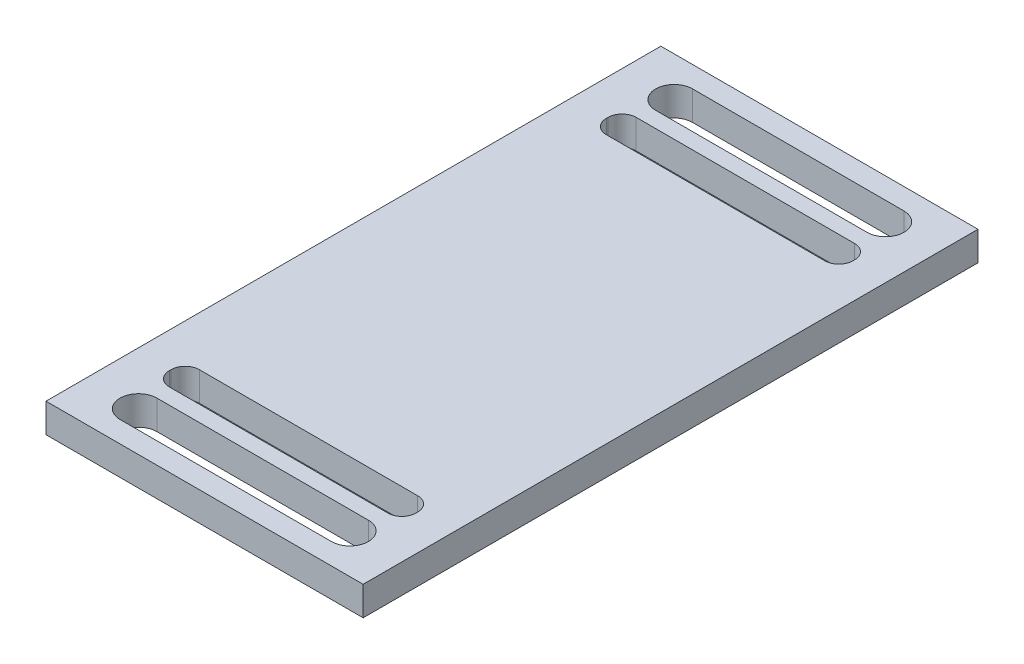
ISO-10303-21;
HEADER;
FILE_DESCRIPTION(('STEP AP214'),'2;1');
FILE_NAME('part.step','',(''),(''),'','','');
FILE_SCHEMA(('AUTOMOTIVE_DESIGN { 1 0 10303 214 1 1 1 1 }'));
ENDSEC;
DATA;
#1=APPLICATION_CONTEXT('core data for automotive mechanical design processes');
#2=APPLICATION_PROTOCOL_DEFINITION('international standard','automotive_design',2000,#1);
#3=PRODUCT_CONTEXT('',#1,'mechanical');
#4=PRODUCT('Part','Part','',(#3));
#5=PRODUCT_RELATED_PRODUCT_CATEGORY('part','',(#4));
#6=PRODUCT_DEFINITION_FORMATION('','',#4);
#7=PRODUCT_DEFINITION_CONTEXT('part definition',#1,'design');
#8=PRODUCT_DEFINITION('design','',#6,#7);
#9=PRODUCT_DEFINITION_SHAPE('','',#8);
#10=(LENGTH_UNIT() NAMED_UNIT(*) SI_UNIT(.MILLI.,.METRE.));
#11=(NAMED_UNIT(*) PLANE_ANGLE_UNIT() SI_UNIT($,.RADIAN.));
#12=(NAMED_UNIT(*) SI_UNIT($,.STERADIAN.) SOLID_ANGLE_UNIT());
#13=UNCERTAINTY_MEASURE_WITH_UNIT(LENGTH_MEASURE(1.E-05),#10,'distance_accuracy_value','');
#14=(GEOMETRIC_REPRESENTATION_CONTEXT(3) GLOBAL_UNCERTAINTY_ASSIGNED_CONTEXT((#13)) GLOBAL_UNIT_ASSIGNED_CONTEXT((#10,
#11,#12)) REPRESENTATION_CONTEXT('',''));
#15=CARTESIAN_POINT('',(0.,0.,0.));
#16=DIRECTION('',(0.,0.,1.));
#17=DIRECTION('',(1.,0.,0.));
#18=AXIS2_PLACEMENT_3D('',#15,#16,#17);
#19=CARTESIAN_POINT('',(-9.,-0.825,-17.45));
#20=DIRECTION('',(-1.,0.,0.));
#21=DIRECTION('',(0.,0.,1.));
#22=AXIS2_PLACEMENT_3D('',#19,#20,#21);
#23=PLANE('',#22);
#24=DIRECTION('',(0.,0.,1.));
#25=VECTOR('',#24,1.);
#26=CARTESIAN_POINT('',(-9.,0.825,-17.45));
#27=LINE('',#26,#25);
#28=CARTESIAN_POINT('',(-9.,0.825,-17.45));
#29=VERTEX_POINT('',#28);
#30=CARTESIAN_POINT('',(-9.,0.825,17.45));
#31=VERTEX_POINT('',#30);
#32=EDGE_CURVE('E309',#29,#31,#27,.T.);
#33=ORIENTED_EDGE('',*,*,#32,.F.);
#34=DIRECTION('',(0.,1.,0.));
#35=VECTOR('',#34,1.);
#36=CARTESIAN_POINT('',(-9.,-0.825,-17.45));
#37=LINE('',#36,#35);
#38=CARTESIAN_POINT('',(-9.,-0.825,-17.45));
#39=VERTEX_POINT('',#38);
#40=EDGE_CURVE('E343',#39,#29,#37,.T.);
#41=ORIENTED_EDGE('',*,*,#40,.F.);
#42=DIRECTION('',(0.,0.,1.));
#43=VECTOR('',#42,1.);
#44=CARTESIAN_POINT('',(-9.,-0.825,-17.45));
#45=LINE('',#44,#43);
#46=CARTESIAN_POINT('',(-9.,-0.825,17.45));
#47=VERTEX_POINT('',#46);
#48=EDGE_CURVE('E319',#39,#47,#45,.T.);
#49=ORIENTED_EDGE('',*,*,#48,.T.);
#50=DIRECTION('',(0.,1.,0.));
#51=VECTOR('',#50,1.);
#52=CARTESIAN_POINT('',(-9.,-0.825,17.45));
#53=LINE('',#52,#51);
#54=EDGE_CURVE('E332',#47,#31,#53,.T.);
#55=ORIENTED_EDGE('',*,*,#54,.T.);
#56=EDGE_LOOP('',(#33,#41,#49,#55));
#57=FACE_BOUND('',#56,.T.);
#58=ADVANCED_FACE('F33',(#57),#23,.T.);
#59=CARTESIAN_POINT('',(-9.,-0.825,-17.45));
#60=DIRECTION('',(0.,0.,-1.));
#61=DIRECTION('',(-1.,0.,0.));
#62=AXIS2_PLACEMENT_3D('',#59,#60,#61);
#63=PLANE('',#62);
#64=DIRECTION('',(-1.,0.,0.));
#65=VECTOR('',#64,1.);
#66=CARTESIAN_POINT('',(-9.,0.825,-17.45));
#67=LINE('',#66,#65);
#68=CARTESIAN_POINT('',(9.,0.825,-17.45));
#69=VERTEX_POINT('',#68);
#70=EDGE_CURVE('E323',#69,#29,#67,.T.);
#71=ORIENTED_EDGE('',*,*,#70,.F.);
#72=DIRECTION('',(0.,1.,0.));
#73=VECTOR('',#72,1.);
#74=CARTESIAN_POINT('',(9.,-0.825,-17.45));
#75=LINE('',#74,#73);
#76=CARTESIAN_POINT('',(9.,-0.825,-17.45));
#77=VERTEX_POINT('',#76);
#78=EDGE_CURVE('E346',#77,#69,#75,.T.);
#79=ORIENTED_EDGE('',*,*,#78,.F.);
#80=DIRECTION('',(-1.,0.,0.));
#81=VECTOR('',#80,1.);
#82=CARTESIAN_POINT('',(-9.,-0.825,-17.45));
#83=LINE('',#82,#81);
#84=EDGE_CURVE('E329',#77,#39,#83,.T.);
#85=ORIENTED_EDGE('',*,*,#84,.T.);
#86=ORIENTED_EDGE('',*,*,#40,.T.);
#87=EDGE_LOOP('',(#71,#79,#85,#86));
#88=FACE_BOUND('',#87,.T.);
#89=ADVANCED_FACE('F463',(#88),#63,.T.);
#90=CARTESIAN_POINT('',(9.,-0.825,-17.45));
#91=DIRECTION('',(1.,0.,0.));
#92=DIRECTION('',(0.,0.,-1.));
#93=AXIS2_PLACEMENT_3D('',#90,#91,#92);
#94=PLANE('',#93);
#95=DIRECTION('',(0.,0.,-1.));
#96=VECTOR('',#95,1.);
#97=CARTESIAN_POINT('',(9.,0.825,-17.45));
#98=LINE('',#97,#96);
#99=CARTESIAN_POINT('',(9.,0.825,17.45));
#100=VERTEX_POINT('',#99);
#101=EDGE_CURVE('E338',#100,#69,#98,.T.);
#102=ORIENTED_EDGE('',*,*,#101,.F.);
#103=DIRECTION('',(0.,1.,0.));
#104=VECTOR('',#103,1.);
#105=CARTESIAN_POINT('',(9.,-0.825,17.45));
#106=LINE('',#105,#104);
#107=CARTESIAN_POINT('',(9.,-0.825,17.45));
#108=VERTEX_POINT('',#107);
#109=EDGE_CURVE('E348',#108,#100,#106,.T.);
#110=ORIENTED_EDGE('',*,*,#109,.F.);
#111=DIRECTION('',(0.,0.,-1.));
#112=VECTOR('',#111,1.);
#113=CARTESIAN_POINT('',(9.,-0.825,-17.45));
#114=LINE('',#113,#112);
#115=EDGE_CURVE('E326',#108,#77,#114,.T.);
#116=ORIENTED_EDGE('',*,*,#115,.T.);
#117=ORIENTED_EDGE('',*,*,#78,.T.);
#118=EDGE_LOOP('',(#102,#110,#116,#117));
#119=FACE_BOUND('',#118,.T.);
#120=ADVANCED_FACE('F469',(#119),#94,.T.);
#121=CARTESIAN_POINT('',(-9.,-0.825,17.45));
#122=DIRECTION('',(0.,0.,1.));
#123=DIRECTION('',(1.,0.,0.));
#124=AXIS2_PLACEMENT_3D('',#121,#122,#123);
#125=PLANE('',#124);
#126=DIRECTION('',(1.,0.,0.));
#127=VECTOR('',#126,1.);
#128=CARTESIAN_POINT('',(-9.,0.825,17.45));
#129=LINE('',#128,#127);
#130=EDGE_CURVE('E335',#31,#100,#129,.T.);
#131=ORIENTED_EDGE('',*,*,#130,.F.);
#132=ORIENTED_EDGE('',*,*,#54,.F.);
#133=DIRECTION('',(1.,0.,0.));
#134=VECTOR('',#133,1.);
#135=CARTESIAN_POINT('',(-9.,-0.825,17.45));
#136=LINE('',#135,#134);
#137=EDGE_CURVE('E322',#47,#108,#136,.T.);
#138=ORIENTED_EDGE('',*,*,#137,.T.);
#139=ORIENTED_EDGE('',*,*,#109,.T.);
#140=EDGE_LOOP('',(#131,#132,#138,#139));
#141=FACE_BOUND('',#140,.T.);
#142=ADVANCED_FACE('F475',(#141),#125,.T.);
#143=CARTESIAN_POINT('',(0.,-0.825,0.));
#144=DIRECTION('',(0.,1.,0.));
#145=DIRECTION('',(0.,0.,1.));
#146=AXIS2_PLACEMENT_3D('',#143,#144,#145);
#147=PLANE('',#146);
#148=DIRECTION('',(-1.,0.,0.));
#149=VECTOR('',#148,1.);
#150=CARTESIAN_POINT('',(-7.,-0.825,11.55));
#151=LINE('',#150,#149);
#152=CARTESIAN_POINT('',(6.2,-0.825,11.55));
#153=VERTEX_POINT('',#152);
#154=CARTESIAN_POINT('',(-6.2,-0.825,11.55));
#155=VERTEX_POINT('',#154);
#156=EDGE_CURVE('E509',#153,#155,#151,.T.);
#157=ORIENTED_EDGE('',*,*,#156,.T.);
#158=CARTESIAN_POINT('',(-6.2,-0.825,12.35));
#159=DIRECTION('',(0.,1.,0.));
#160=DIRECTION('',(0.,0.,1.));
#161=AXIS2_PLACEMENT_3D('',#158,#159,#160);
#162=CIRCLE('',#161,0.8);
#163=CARTESIAN_POINT('',(-7.,-0.825,12.35));
#164=VERTEX_POINT('',#163);
#165=EDGE_CURVE('E403',#155,#164,#162,.T.);
#166=ORIENTED_EDGE('',*,*,#165,.T.);
#167=DIRECTION('',(0.,0.,1.));
#168=VECTOR('',#167,1.);
#169=CARTESIAN_POINT('',(-7.,-0.825,13.25));
#170=LINE('',#169,#168);
#171=CARTESIAN_POINT('',(-7.,-0.825,12.45));
#172=VERTEX_POINT('',#171);
#173=EDGE_CURVE('E256',#164,#172,#170,.T.);
#174=ORIENTED_EDGE('',*,*,#173,.T.);
#175=CARTESIAN_POINT('',(-6.2,-0.825,12.45));
#176=DIRECTION('',(0.,1.,0.));
#177=DIRECTION('',(0.,0.,1.));
#178=AXIS2_PLACEMENT_3D('',#175,#176,#177);
#179=CIRCLE('',#178,0.8);
#180=CARTESIAN_POINT('',(-6.2,-0.825,13.25));
#181=VERTEX_POINT('',#180);
#182=EDGE_CURVE('E399',#172,#181,#179,.T.);
#183=ORIENTED_EDGE('',*,*,#182,.T.);
#184=DIRECTION('',(1.,0.,0.));
#185=VECTOR('',#184,1.);
#186=CARTESIAN_POINT('',(-7.,-0.825,13.25));
#187=LINE('',#186,#185);
#188=CARTESIAN_POINT('',(6.2,-0.825,13.25));
#189=VERTEX_POINT('',#188);
#190=EDGE_CURVE('E498',#181,#189,#187,.T.);
#191=ORIENTED_EDGE('',*,*,#190,.T.);
#192=CARTESIAN_POINT('',(6.2,-0.825,12.45));
#193=DIRECTION('',(0.,1.,0.));
#194=DIRECTION('',(0.,0.,1.));
#195=AXIS2_PLACEMENT_3D('',#192,#193,#194);
#196=CIRCLE('',#195,0.8);
#197=CARTESIAN_POINT('',(7.,-0.825,12.45));
#198=VERTEX_POINT('',#197);
#199=EDGE_CURVE('E391',#189,#198,#196,.T.);
#200=ORIENTED_EDGE('',*,*,#199,.T.);
#201=DIRECTION('',(0.,0.,-1.));
#202=VECTOR('',#201,1.);
#203=CARTESIAN_POINT('',(7.,-0.825,13.25));
#204=LINE('',#203,#202);
#205=CARTESIAN_POINT('',(7.,-0.825,12.35));
#206=VERTEX_POINT('',#205);
#207=EDGE_CURVE('E506',#198,#206,#204,.T.);
#208=ORIENTED_EDGE('',*,*,#207,.T.);
#209=CARTESIAN_POINT('',(6.2,-0.825,12.35));
#210=DIRECTION('',(0.,1.,0.));
#211=DIRECTION('',(0.,0.,1.));
#212=AXIS2_PLACEMENT_3D('',#209,#210,#211);
#213=CIRCLE('',#212,0.8);
#214=EDGE_CURVE('E395',#206,#153,#213,.T.);
#215=ORIENTED_EDGE('',*,*,#214,.T.);
#216=EDGE_LOOP('',(#157,#166,#174,#183,#191,#200,#208,#215));
#217=FACE_BOUND('',#216,.T.);
#218=DIRECTION('',(-1.,0.,0.));
#219=VECTOR('',#218,1.);
#220=CARTESIAN_POINT('',(-5.99999999999999,-0.825,14.15));
#221=LINE('',#220,#219);
#222=CARTESIAN_POINT('',(6.,-0.825,14.15));
#223=VERTEX_POINT('',#222);
#224=CARTESIAN_POINT('',(-5.99999999999999,-0.825,14.15));
#225=VERTEX_POINT('',#224);
#226=EDGE_CURVE('E230',#223,#225,#221,.T.);
#227=ORIENTED_EDGE('',*,*,#226,.T.);
#228=CARTESIAN_POINT('',(-5.99999999999999,-0.825,15.2));
#229=DIRECTION('',(0.,1.,0.));
#230=DIRECTION('',(0.,0.,-1.));
#231=AXIS2_PLACEMENT_3D('',#228,#229,#230);
#232=CIRCLE('',#231,1.05);
#233=CARTESIAN_POINT('',(-5.99999999999999,-0.825,16.25));
#234=VERTEX_POINT('',#233);
#235=EDGE_CURVE('E222',#225,#234,#232,.T.);
#236=ORIENTED_EDGE('',*,*,#235,.T.);
#237=DIRECTION('',(1.,0.,0.));
#238=VECTOR('',#237,1.);
#239=CARTESIAN_POINT('',(-5.99999999999999,-0.825,16.25));
#240=LINE('',#239,#238);
#241=CARTESIAN_POINT('',(6.,-0.825,16.25));
#242=VERTEX_POINT('',#241);
#243=EDGE_CURVE('E234',#234,#242,#240,.T.);
#244=ORIENTED_EDGE('',*,*,#243,.T.);
#245=CARTESIAN_POINT('',(6.,-0.825,15.2));
#246=DIRECTION('',(0.,1.,0.));
#247=DIRECTION('',(0.,0.,-1.));
#248=AXIS2_PLACEMENT_3D('',#245,#246,#247);
#249=CIRCLE('',#248,1.05);
#250=EDGE_CURVE('E238',#242,#223,#249,.T.);
#251=ORIENTED_EDGE('',*,*,#250,.T.);
#252=EDGE_LOOP('',(#227,#236,#244,#251));
#253=FACE_BOUND('',#252,.T.);
#254=DIRECTION('',(-1.,0.,0.));
#255=VECTOR('',#254,1.);
#256=CARTESIAN_POINT('',(-6.,-0.825,-16.25));
#257=LINE('',#256,#255);
#258=CARTESIAN_POINT('',(6.,-0.825,-16.25));
#259=VERTEX_POINT('',#258);
#260=CARTESIAN_POINT('',(-6.,-0.825,-16.25));
#261=VERTEX_POINT('',#260);
#262=EDGE_CURVE('E276',#259,#261,#257,.T.);
#263=ORIENTED_EDGE('',*,*,#262,.T.);
#264=CARTESIAN_POINT('',(-6.,-0.825,-15.2));
#265=DIRECTION('',(0.,1.,0.));
#266=DIRECTION('',(0.,0.,1.));
#267=AXIS2_PLACEMENT_3D('',#264,#265,#266);
#268=CIRCLE('',#267,1.05);
#269=CARTESIAN_POINT('',(-5.99999999999999,-0.825,-14.15));
#270=VERTEX_POINT('',#269);
#271=EDGE_CURVE('E266',#261,#270,#268,.T.);
#272=ORIENTED_EDGE('',*,*,#271,.T.);
#273=DIRECTION('',(1.,0.,0.));
#274=VECTOR('',#273,1.);
#275=CARTESIAN_POINT('',(-5.99999999999999,-0.825,-14.15));
#276=LINE('',#275,#274);
#277=CARTESIAN_POINT('',(5.99999999999999,-0.825,-14.15));
#278=VERTEX_POINT('',#277);
#279=EDGE_CURVE('E269',#270,#278,#276,.T.);
#280=ORIENTED_EDGE('',*,*,#279,.T.);
#281=CARTESIAN_POINT('',(6.,-0.825,-15.2));
#282=DIRECTION('',(0.,1.,0.));
#283=DIRECTION('',(0.,0.,1.));
#284=AXIS2_PLACEMENT_3D('',#281,#282,#283);
#285=CIRCLE('',#284,1.05);
#286=EDGE_CURVE('E273',#278,#259,#285,.T.);
#287=ORIENTED_EDGE('',*,*,#286,.T.);
#288=EDGE_LOOP('',(#263,#272,#280,#287));
#289=FACE_BOUND('',#288,.T.);
#290=DIRECTION('',(0.,0.,-1.));
#291=VECTOR('',#290,1.);
#292=CARTESIAN_POINT('',(7.,-0.825,-13.25));
#293=LINE('',#292,#291);
#294=CARTESIAN_POINT('',(7.,-0.825,-12.35));
#295=VERTEX_POINT('',#294);
#296=CARTESIAN_POINT('',(7.,-0.825,-12.45));
#297=VERTEX_POINT('',#296);
#298=EDGE_CURVE('E304',#295,#297,#293,.T.);
#299=ORIENTED_EDGE('',*,*,#298,.T.);
#300=CARTESIAN_POINT('',(6.2,-0.825,-12.45));
#301=DIRECTION('',(0.,1.,0.));
#302=DIRECTION('',(0.,0.,1.));
#303=AXIS2_PLACEMENT_3D('',#300,#301,#302);
#304=CIRCLE('',#303,0.8);
#305=CARTESIAN_POINT('',(6.2,-0.825,-13.25));
#306=VERTEX_POINT('',#305);
#307=EDGE_CURVE('E407',#297,#306,#304,.T.);
#308=ORIENTED_EDGE('',*,*,#307,.T.);
#309=DIRECTION('',(-1.,0.,0.));
#310=VECTOR('',#309,1.);
#311=CARTESIAN_POINT('',(-7.,-0.825,-13.25));
#312=LINE('',#311,#310);
#313=CARTESIAN_POINT('',(-6.2,-0.825,-13.25));
#314=VERTEX_POINT('',#313);
#315=EDGE_CURVE('E307',#306,#314,#312,.T.);
#316=ORIENTED_EDGE('',*,*,#315,.T.);
#317=CARTESIAN_POINT('',(-6.2,-0.825,-12.45));
#318=DIRECTION('',(0.,1.,0.));
#319=DIRECTION('',(0.,0.,1.));
#320=AXIS2_PLACEMENT_3D('',#317,#318,#319);
#321=CIRCLE('',#320,0.8);
#322=CARTESIAN_POINT('',(-7.,-0.825,-12.45));
#323=VERTEX_POINT('',#322);
#324=EDGE_CURVE('E11',#314,#323,#321,.T.);
#325=ORIENTED_EDGE('',*,*,#324,.T.);
#326=DIRECTION('',(0.,0.,1.));
#327=VECTOR('',#326,1.);
#328=CARTESIAN_POINT('',(-7.,-0.825,-13.25));
#329=LINE('',#328,#327);
#330=CARTESIAN_POINT('',(-7.,-0.825,-12.35));
#331=VERTEX_POINT('',#330);
#332=EDGE_CURVE('E298',#323,#331,#329,.T.);
#333=ORIENTED_EDGE('',*,*,#332,.T.);
#334=CARTESIAN_POINT('',(-6.2,-0.825,-12.35));
#335=DIRECTION('',(0.,1.,0.));
#336=DIRECTION('',(0.,0.,1.));
#337=AXIS2_PLACEMENT_3D('',#334,#335,#336);
#338=CIRCLE('',#337,0.8);
#339=CARTESIAN_POINT('',(-6.2,-0.825,-11.55));
#340=VERTEX_POINT('',#339);
#341=EDGE_CURVE('E415',#331,#340,#338,.T.);
#342=ORIENTED_EDGE('',*,*,#341,.T.);
#343=DIRECTION('',(1.,0.,0.));
#344=VECTOR('',#343,1.);
#345=CARTESIAN_POINT('',(-7.,-0.825,-11.55));
#346=LINE('',#345,#344);
#347=CARTESIAN_POINT('',(6.2,-0.825,-11.55));
#348=VERTEX_POINT('',#347);
#349=EDGE_CURVE('E300',#340,#348,#346,.T.);
#350=ORIENTED_EDGE('',*,*,#349,.T.);
#351=CARTESIAN_POINT('',(6.2,-0.825,-12.35));
#352=DIRECTION('',(0.,1.,0.));
#353=DIRECTION('',(0.,0.,1.));
#354=AXIS2_PLACEMENT_3D('',#351,#352,#353);
#355=CIRCLE('',#354,0.8);
#356=EDGE_CURVE('E411',#348,#295,#355,.T.);
#357=ORIENTED_EDGE('',*,*,#356,.T.);
#358=EDGE_LOOP('',(#299,#308,#316,#325,#333,#342,#350,#357));
#359=FACE_BOUND('',#358,.T.);
#360=ORIENTED_EDGE('',*,*,#48,.F.);
#361=ORIENTED_EDGE('',*,*,#84,.F.);
#362=ORIENTED_EDGE('',*,*,#115,.F.);
#363=ORIENTED_EDGE('',*,*,#137,.F.);
#364=EDGE_LOOP('',(#360,#361,#362,#363));
#365=FACE_BOUND('',#364,.T.);
#366=ADVANCED_FACE('F240',(#217,#253,#289,#359,#365),#147,.F.);
#367=CARTESIAN_POINT('',(0.,0.825,0.));
#368=DIRECTION('',(0.,1.,0.));
#369=DIRECTION('',(0.,0.,1.));
#370=AXIS2_PLACEMENT_3D('',#367,#368,#369);
#371=PLANE('',#370);
#372=DIRECTION('',(1.,0.,0.));
#373=VECTOR('',#372,1.);
#374=CARTESIAN_POINT('',(-7.,0.825,13.25));
#375=LINE('',#374,#373);
#376=CARTESIAN_POINT('',(-6.2,0.825,13.25));
#377=VERTEX_POINT('',#376);
#378=CARTESIAN_POINT('',(6.2,0.825,13.25));
#379=VERTEX_POINT('',#378);
#380=EDGE_CURVE('E516',#377,#379,#375,.T.);
#381=ORIENTED_EDGE('',*,*,#380,.F.);
#382=CARTESIAN_POINT('',(-6.2,0.825,12.45));
#383=DIRECTION('',(0.,1.,0.));
#384=DIRECTION('',(0.,0.,1.));
#385=AXIS2_PLACEMENT_3D('',#382,#383,#384);
#386=CIRCLE('',#385,0.8);
#387=CARTESIAN_POINT('',(-7.,0.825,12.45));
#388=VERTEX_POINT('',#387);
#389=EDGE_CURVE('E397',#377,#388,#386,.F.);
#390=ORIENTED_EDGE('',*,*,#389,.T.);
#391=DIRECTION('',(0.,0.,1.));
#392=VECTOR('',#391,1.);
#393=CARTESIAN_POINT('',(-7.,0.825,13.25));
#394=LINE('',#393,#392);
#395=CARTESIAN_POINT('',(-7.,0.825,12.35));
#396=VERTEX_POINT('',#395);
#397=EDGE_CURVE('E249',#396,#388,#394,.T.);
#398=ORIENTED_EDGE('',*,*,#397,.F.);
#399=CARTESIAN_POINT('',(-6.2,0.825,12.35));
#400=DIRECTION('',(0.,1.,0.));
#401=DIRECTION('',(0.,0.,1.));
#402=AXIS2_PLACEMENT_3D('',#399,#400,#401);
#403=CIRCLE('',#402,0.8);
#404=CARTESIAN_POINT('',(-6.2,0.825,11.55));
#405=VERTEX_POINT('',#404);
#406=EDGE_CURVE('E401',#396,#405,#403,.F.);
#407=ORIENTED_EDGE('',*,*,#406,.T.);
#408=DIRECTION('',(-1.,0.,0.));
#409=VECTOR('',#408,1.);
#410=CARTESIAN_POINT('',(-7.,0.825,11.55));
#411=LINE('',#410,#409);
#412=CARTESIAN_POINT('',(6.2,0.825,11.55));
#413=VERTEX_POINT('',#412);
#414=EDGE_CURVE('E512',#413,#405,#411,.T.);
#415=ORIENTED_EDGE('',*,*,#414,.F.);
#416=CARTESIAN_POINT('',(6.2,0.825,12.35));
#417=DIRECTION('',(0.,1.,0.));
#418=DIRECTION('',(0.,0.,1.));
#419=AXIS2_PLACEMENT_3D('',#416,#417,#418);
#420=CIRCLE('',#419,0.8);
#421=CARTESIAN_POINT('',(7.,0.825,12.35));
#422=VERTEX_POINT('',#421);
#423=EDGE_CURVE('E393',#413,#422,#420,.F.);
#424=ORIENTED_EDGE('',*,*,#423,.T.);
#425=DIRECTION('',(0.,0.,-1.));
#426=VECTOR('',#425,1.);
#427=CARTESIAN_POINT('',(7.,0.825,13.25));
#428=LINE('',#427,#426);
#429=CARTESIAN_POINT('',(7.,0.825,12.45));
#430=VERTEX_POINT('',#429);
#431=EDGE_CURVE('E518',#430,#422,#428,.T.);
#432=ORIENTED_EDGE('',*,*,#431,.F.);
#433=CARTESIAN_POINT('',(6.2,0.825,12.45));
#434=DIRECTION('',(0.,1.,0.));
#435=DIRECTION('',(0.,0.,1.));
#436=AXIS2_PLACEMENT_3D('',#433,#434,#435);
#437=CIRCLE('',#436,0.8);
#438=EDGE_CURVE('E389',#430,#379,#437,.F.);
#439=ORIENTED_EDGE('',*,*,#438,.T.);
#440=EDGE_LOOP('',(#381,#390,#398,#407,#415,#424,#432,#439));
#441=FACE_BOUND('',#440,.T.);
#442=CARTESIAN_POINT('',(-5.99999999999999,0.825,15.2));
#443=DIRECTION('',(0.,1.,0.));
#444=DIRECTION('',(0.,0.,-1.));
#445=AXIS2_PLACEMENT_3D('',#442,#443,#444);
#446=CIRCLE('',#445,1.05);
#447=CARTESIAN_POINT('',(-5.99999999999999,0.825,14.15));
#448=VERTEX_POINT('',#447);
#449=CARTESIAN_POINT('',(-5.99999999999999,0.825,16.25));
#450=VERTEX_POINT('',#449);
#451=EDGE_CURVE('E225',#448,#450,#446,.T.);
#452=ORIENTED_EDGE('',*,*,#451,.F.);
#453=DIRECTION('',(-1.,0.,0.));
#454=VECTOR('',#453,1.);
#455=CARTESIAN_POINT('',(-5.99999999999999,0.825,14.15));
#456=LINE('',#455,#454);
#457=CARTESIAN_POINT('',(6.,0.825,14.15));
#458=VERTEX_POINT('',#457);
#459=EDGE_CURVE('E243',#458,#448,#456,.T.);
#460=ORIENTED_EDGE('',*,*,#459,.F.);
#461=CARTESIAN_POINT('',(6.,0.825,15.2));
#462=DIRECTION('',(0.,1.,0.));
#463=DIRECTION('',(0.,0.,-1.));
#464=AXIS2_PLACEMENT_3D('',#461,#462,#463);
#465=CIRCLE('',#464,1.05);
#466=CARTESIAN_POINT('',(6.,0.825,16.25));
#467=VERTEX_POINT('',#466);
#468=EDGE_CURVE('E246',#467,#458,#465,.T.);
#469=ORIENTED_EDGE('',*,*,#468,.F.);
#470=DIRECTION('',(1.,0.,0.));
#471=VECTOR('',#470,1.);
#472=CARTESIAN_POINT('',(-5.99999999999999,0.825,16.25));
#473=LINE('',#472,#471);
#474=EDGE_CURVE('E255',#450,#467,#473,.T.);
#475=ORIENTED_EDGE('',*,*,#474,.F.);
#476=EDGE_LOOP('',(#452,#460,#469,#475));
#477=FACE_BOUND('',#476,.T.);
#478=CARTESIAN_POINT('',(-6.,0.825,-15.2));
#479=DIRECTION('',(0.,1.,0.));
#480=DIRECTION('',(0.,0.,1.));
#481=AXIS2_PLACEMENT_3D('',#478,#479,#480);
#482=CIRCLE('',#481,1.05);
#483=CARTESIAN_POINT('',(-6.,0.825,-16.25));
#484=VERTEX_POINT('',#483);
#485=CARTESIAN_POINT('',(-5.99999999999999,0.825,-14.15));
#486=VERTEX_POINT('',#485);
#487=EDGE_CURVE('E262',#484,#486,#482,.T.);
#488=ORIENTED_EDGE('',*,*,#487,.F.);
#489=DIRECTION('',(-1.,0.,0.));
#490=VECTOR('',#489,1.);
#491=CARTESIAN_POINT('',(-6.,0.825,-16.25));
#492=LINE('',#491,#490);
#493=CARTESIAN_POINT('',(6.,0.825,-16.25));
#494=VERTEX_POINT('',#493);
#495=EDGE_CURVE('E270',#494,#484,#492,.T.);
#496=ORIENTED_EDGE('',*,*,#495,.F.);
#497=CARTESIAN_POINT('',(6.,0.825,-15.2));
#498=DIRECTION('',(0.,1.,0.));
#499=DIRECTION('',(0.,0.,1.));
#500=AXIS2_PLACEMENT_3D('',#497,#498,#499);
#501=CIRCLE('',#500,1.05);
#502=CARTESIAN_POINT('',(5.99999999999999,0.825,-14.15));
#503=VERTEX_POINT('',#502);
#504=EDGE_CURVE('E284',#503,#494,#501,.T.);
#505=ORIENTED_EDGE('',*,*,#504,.F.);
#506=DIRECTION('',(1.,0.,0.));
#507=VECTOR('',#506,1.);
#508=CARTESIAN_POINT('',(-5.99999999999999,0.825,-14.15));
#509=LINE('',#508,#507);
#510=EDGE_CURVE('E281',#486,#503,#509,.T.);
#511=ORIENTED_EDGE('',*,*,#510,.F.);
#512=EDGE_LOOP('',(#488,#496,#505,#511));
#513=FACE_BOUND('',#512,.T.);
#514=DIRECTION('',(0.,0.,1.));
#515=VECTOR('',#514,1.);
#516=CARTESIAN_POINT('',(-7.,0.825,-13.25));
#517=LINE('',#516,#515);
#518=CARTESIAN_POINT('',(-7.,0.825,-12.45));
#519=VERTEX_POINT('',#518);
#520=CARTESIAN_POINT('',(-7.,0.825,-12.35));
#521=VERTEX_POINT('',#520);
#522=EDGE_CURVE('E291',#519,#521,#517,.T.);
#523=ORIENTED_EDGE('',*,*,#522,.F.);
#524=CARTESIAN_POINT('',(-6.2,0.825,-12.45));
#525=DIRECTION('',(0.,1.,0.));
#526=DIRECTION('',(0.,0.,1.));
#527=AXIS2_PLACEMENT_3D('',#524,#525,#526);
#528=CIRCLE('',#527,0.8);
#529=CARTESIAN_POINT('',(-6.2,0.825,-13.25));
#530=VERTEX_POINT('',#529);
#531=EDGE_CURVE('E41',#519,#530,#528,.F.);
#532=ORIENTED_EDGE('',*,*,#531,.T.);
#533=DIRECTION('',(-1.,0.,0.));
#534=VECTOR('',#533,1.);
#535=CARTESIAN_POINT('',(-7.,0.825,-13.25));
#536=LINE('',#535,#534);
#537=CARTESIAN_POINT('',(6.2,0.825,-13.25));
#538=VERTEX_POINT('',#537);
#539=EDGE_CURVE('E301',#538,#530,#536,.T.);
#540=ORIENTED_EDGE('',*,*,#539,.F.);
#541=CARTESIAN_POINT('',(6.2,0.825,-12.45));
#542=DIRECTION('',(0.,1.,0.));
#543=DIRECTION('',(0.,0.,1.));
#544=AXIS2_PLACEMENT_3D('',#541,#542,#543);
#545=CIRCLE('',#544,0.8);
#546=CARTESIAN_POINT('',(7.,0.825,-12.45));
#547=VERTEX_POINT('',#546);
#548=EDGE_CURVE('E405',#538,#547,#545,.F.);
#549=ORIENTED_EDGE('',*,*,#548,.T.);
#550=DIRECTION('',(0.,0.,-1.));
#551=VECTOR('',#550,1.);
#552=CARTESIAN_POINT('',(7.,0.825,-13.25));
#553=LINE('',#552,#551);
#554=CARTESIAN_POINT('',(7.,0.825,-12.35));
#555=VERTEX_POINT('',#554);
#556=EDGE_CURVE('E314',#555,#547,#553,.T.);
#557=ORIENTED_EDGE('',*,*,#556,.F.);
#558=CARTESIAN_POINT('',(6.2,0.825,-12.35));
#559=DIRECTION('',(0.,1.,0.));
#560=DIRECTION('',(0.,0.,1.));
#561=AXIS2_PLACEMENT_3D('',#558,#559,#560);
#562=CIRCLE('',#561,0.8);
#563=CARTESIAN_POINT('',(6.2,0.825,-11.55));
#564=VERTEX_POINT('',#563);
#565=EDGE_CURVE('E409',#555,#564,#562,.F.);
#566=ORIENTED_EDGE('',*,*,#565,.T.);
#567=DIRECTION('',(1.,0.,0.));
#568=VECTOR('',#567,1.);
#569=CARTESIAN_POINT('',(-7.,0.825,-11.55));
#570=LINE('',#569,#568);
#571=CARTESIAN_POINT('',(-6.2,0.825,-11.55));
#572=VERTEX_POINT('',#571);
#573=EDGE_CURVE('E311',#572,#564,#570,.T.);
#574=ORIENTED_EDGE('',*,*,#573,.F.);
#575=CARTESIAN_POINT('',(-6.2,0.825,-12.35));
#576=DIRECTION('',(0.,1.,0.));
#577=DIRECTION('',(0.,0.,1.));
#578=AXIS2_PLACEMENT_3D('',#575,#576,#577);
#579=CIRCLE('',#578,0.8);
#580=EDGE_CURVE('E413',#572,#521,#579,.F.);
#581=ORIENTED_EDGE('',*,*,#580,.T.);
#582=EDGE_LOOP('',(#523,#532,#540,#549,#557,#566,#574,#581));
#583=FACE_BOUND('',#582,.T.);
#584=ORIENTED_EDGE('',*,*,#32,.T.);
#585=ORIENTED_EDGE('',*,*,#130,.T.);
#586=ORIENTED_EDGE('',*,*,#101,.T.);
#587=ORIENTED_EDGE('',*,*,#70,.T.);
#588=EDGE_LOOP('',(#584,#585,#586,#587));
#589=FACE_BOUND('',#588,.T.);
#590=ADVANCED_FACE('F419',(#441,#477,#513,#583,#589),#371,.T.);
#591=CARTESIAN_POINT('',(-7.,-0.825,-13.25));
#592=DIRECTION('',(-1.,0.,0.));
#593=DIRECTION('',(0.,0.,1.));
#594=AXIS2_PLACEMENT_3D('',#591,#592,#593);
#595=PLANE('',#594);
#596=ORIENTED_EDGE('',*,*,#522,.T.);
#597=DIRECTION('',(0.,1.,0.));
#598=VECTOR('',#597,1.);
#599=CARTESIAN_POINT('',(-7.,-0.825,-12.35));
#600=LINE('',#599,#598);
#601=EDGE_CURVE('E48',#521,#331,#600,.F.);
#602=ORIENTED_EDGE('',*,*,#601,.T.);
#603=ORIENTED_EDGE('',*,*,#332,.F.);
#604=DIRECTION('',(0.,1.,0.));
#605=VECTOR('',#604,1.);
#606=CARTESIAN_POINT('',(-7.,0.825,-12.45));
#607=LINE('',#606,#605);
#608=EDGE_CURVE('E385',#323,#519,#607,.T.);
#609=ORIENTED_EDGE('',*,*,#608,.T.);
#610=EDGE_LOOP('',(#596,#602,#603,#609));
#611=FACE_BOUND('',#610,.T.);
#612=ADVANCED_FACE('F428',(#611),#595,.F.);
#613=CARTESIAN_POINT('',(-7.,-0.825,-13.25));
#614=DIRECTION('',(0.,0.,-1.));
#615=DIRECTION('',(-1.,0.,0.));
#616=AXIS2_PLACEMENT_3D('',#613,#614,#615);
#617=PLANE('',#616);
#618=ORIENTED_EDGE('',*,*,#315,.F.);
#619=DIRECTION('',(0.,1.,0.));
#620=VECTOR('',#619,1.);
#621=CARTESIAN_POINT('',(6.2,0.825,-13.25));
#622=LINE('',#621,#620);
#623=EDGE_CURVE('E372',#306,#538,#622,.T.);
#624=ORIENTED_EDGE('',*,*,#623,.T.);
#625=ORIENTED_EDGE('',*,*,#539,.T.);
#626=DIRECTION('',(0.,1.,0.));
#627=VECTOR('',#626,1.);
#628=CARTESIAN_POINT('',(-6.2,-0.825,-13.25));
#629=LINE('',#628,#627);
#630=EDGE_CURVE('E370',#530,#314,#629,.F.);
#631=ORIENTED_EDGE('',*,*,#630,.T.);
#632=EDGE_LOOP('',(#618,#624,#625,#631));
#633=FACE_BOUND('',#632,.T.);
#634=ADVANCED_FACE('F426',(#633),#617,.F.);
#635=CARTESIAN_POINT('',(7.,-0.825,-13.25));
#636=DIRECTION('',(1.,0.,0.));
#637=DIRECTION('',(0.,0.,-1.));
#638=AXIS2_PLACEMENT_3D('',#635,#636,#637);
#639=PLANE('',#638);
#640=ORIENTED_EDGE('',*,*,#556,.T.);
#641=DIRECTION('',(0.,1.,0.));
#642=VECTOR('',#641,1.);
#643=CARTESIAN_POINT('',(7.,-0.825,-12.45));
#644=LINE('',#643,#642);
#645=EDGE_CURVE('E378',#547,#297,#644,.F.);
#646=ORIENTED_EDGE('',*,*,#645,.T.);
#647=ORIENTED_EDGE('',*,*,#298,.F.);
#648=DIRECTION('',(0.,1.,0.));
#649=VECTOR('',#648,1.);
#650=CARTESIAN_POINT('',(7.,0.825,-12.35));
#651=LINE('',#650,#649);
#652=EDGE_CURVE('E375',#295,#555,#651,.T.);
#653=ORIENTED_EDGE('',*,*,#652,.T.);
#654=EDGE_LOOP('',(#640,#646,#647,#653));
#655=FACE_BOUND('',#654,.T.);
#656=ADVANCED_FACE('F446',(#655),#639,.F.);
#657=CARTESIAN_POINT('',(-7.,-0.825,-11.55));
#658=DIRECTION('',(0.,0.,1.));
#659=DIRECTION('',(1.,0.,0.));
#660=AXIS2_PLACEMENT_3D('',#657,#658,#659);
#661=PLANE('',#660);
#662=ORIENTED_EDGE('',*,*,#573,.T.);
#663=DIRECTION('',(0.,1.,0.));
#664=VECTOR('',#663,1.);
#665=CARTESIAN_POINT('',(6.2,-0.825,-11.55));
#666=LINE('',#665,#664);
#667=EDGE_CURVE('E383',#564,#348,#666,.F.);
#668=ORIENTED_EDGE('',*,*,#667,.T.);
#669=ORIENTED_EDGE('',*,*,#349,.F.);
#670=DIRECTION('',(0.,1.,0.));
#671=VECTOR('',#670,1.);
#672=CARTESIAN_POINT('',(-6.2,0.825,-11.55));
#673=LINE('',#672,#671);
#674=EDGE_CURVE('E380',#340,#572,#673,.T.);
#675=ORIENTED_EDGE('',*,*,#674,.T.);
#676=EDGE_LOOP('',(#662,#668,#669,#675));
#677=FACE_BOUND('',#676,.T.);
#678=ADVANCED_FACE('F437',(#677),#661,.F.);
#679=CARTESIAN_POINT('',(-6.,-0.825,-15.2));
#680=DIRECTION('',(0.,1.,0.));
#681=DIRECTION('',(0.,0.,1.));
#682=AXIS2_PLACEMENT_3D('',#679,#680,#681);
#683=CYLINDRICAL_SURFACE('',#682,1.05);
#684=ORIENTED_EDGE('',*,*,#487,.T.);
#685=DIRECTION('',(0.,1.,0.));
#686=VECTOR('',#685,1.);
#687=CARTESIAN_POINT('',(-5.99999999999999,-0.825,-14.15));
#688=LINE('',#687,#686);
#689=EDGE_CURVE('E279',#270,#486,#688,.T.);
#690=ORIENTED_EDGE('',*,*,#689,.F.);
#691=ORIENTED_EDGE('',*,*,#271,.F.);
#692=DIRECTION('',(0.,1.,0.));
#693=VECTOR('',#692,1.);
#694=CARTESIAN_POINT('',(-6.,-0.825,-16.25));
#695=LINE('',#694,#693);
#696=EDGE_CURVE('E289',#261,#484,#695,.T.);
#697=ORIENTED_EDGE('',*,*,#696,.T.);
#698=EDGE_LOOP('',(#684,#690,#691,#697));
#699=FACE_BOUND('',#698,.T.);
#700=ADVANCED_FACE('F567',(#699),#683,.F.);
#701=CARTESIAN_POINT('',(-6.,-0.825,-16.25));
#702=DIRECTION('',(0.,0.,-1.));
#703=DIRECTION('',(-1.,0.,0.));
#704=AXIS2_PLACEMENT_3D('',#701,#702,#703);
#705=PLANE('',#704);
#706=ORIENTED_EDGE('',*,*,#495,.T.);
#707=ORIENTED_EDGE('',*,*,#696,.F.);
#708=ORIENTED_EDGE('',*,*,#262,.F.);
#709=DIRECTION('',(0.,1.,0.));
#710=VECTOR('',#709,1.);
#711=CARTESIAN_POINT('',(6.,-0.825,-16.25));
#712=LINE('',#711,#710);
#713=EDGE_CURVE('E292',#259,#494,#712,.T.);
#714=ORIENTED_EDGE('',*,*,#713,.T.);
#715=EDGE_LOOP('',(#706,#707,#708,#714));
#716=FACE_BOUND('',#715,.T.);
#717=ADVANCED_FACE('F563',(#716),#705,.F.);
#718=CARTESIAN_POINT('',(6.,-0.825,-15.2));
#719=DIRECTION('',(0.,1.,0.));
#720=DIRECTION('',(0.,0.,1.));
#721=AXIS2_PLACEMENT_3D('',#718,#719,#720);
#722=CYLINDRICAL_SURFACE('',#721,1.05);
#723=ORIENTED_EDGE('',*,*,#504,.T.);
#724=ORIENTED_EDGE('',*,*,#713,.F.);
#725=ORIENTED_EDGE('',*,*,#286,.F.);
#726=DIRECTION('',(0.,1.,0.));
#727=VECTOR('',#726,1.);
#728=CARTESIAN_POINT('',(5.99999999999999,-0.825,-14.15));
#729=LINE('',#728,#727);
#730=EDGE_CURVE('E294',#278,#503,#729,.T.);
#731=ORIENTED_EDGE('',*,*,#730,.T.);
#732=EDGE_LOOP('',(#723,#724,#725,#731));
#733=FACE_BOUND('',#732,.T.);
#734=ADVANCED_FACE('F566',(#733),#722,.F.);
#735=CARTESIAN_POINT('',(-5.99999999999999,-0.825,-14.15));
#736=DIRECTION('',(0.,0.,1.));
#737=DIRECTION('',(1.,0.,0.));
#738=AXIS2_PLACEMENT_3D('',#735,#736,#737);
#739=PLANE('',#738);
#740=ORIENTED_EDGE('',*,*,#510,.T.);
#741=ORIENTED_EDGE('',*,*,#730,.F.);
#742=ORIENTED_EDGE('',*,*,#279,.F.);
#743=ORIENTED_EDGE('',*,*,#689,.T.);
#744=EDGE_LOOP('',(#740,#741,#742,#743));
#745=FACE_BOUND('',#744,.T.);
#746=ADVANCED_FACE('F562',(#745),#739,.F.);
#747=CARTESIAN_POINT('',(-5.99999999999999,-0.825,15.2));
#748=DIRECTION('',(0.,1.,0.));
#749=DIRECTION('',(0.,0.,1.));
#750=AXIS2_PLACEMENT_3D('',#747,#748,#749);
#751=CYLINDRICAL_SURFACE('',#750,1.05);
#752=ORIENTED_EDGE('',*,*,#451,.T.);
#753=DIRECTION('',(0.,1.,0.));
#754=VECTOR('',#753,1.);
#755=CARTESIAN_POINT('',(-5.99999999999999,-0.825,16.25));
#756=LINE('',#755,#754);
#757=EDGE_CURVE('E218',#234,#450,#756,.T.);
#758=ORIENTED_EDGE('',*,*,#757,.F.);
#759=ORIENTED_EDGE('',*,*,#235,.F.);
#760=DIRECTION('',(0.,1.,0.));
#761=VECTOR('',#760,1.);
#762=CARTESIAN_POINT('',(-5.99999999999999,-0.825,14.15));
#763=LINE('',#762,#761);
#764=EDGE_CURVE('E260',#225,#448,#763,.T.);
#765=ORIENTED_EDGE('',*,*,#764,.T.);
#766=EDGE_LOOP('',(#752,#758,#759,#765));
#767=FACE_BOUND('',#766,.T.);
#768=ADVANCED_FACE('F220',(#767),#751,.F.);
#769=CARTESIAN_POINT('',(-5.99999999999999,-0.825,14.15));
#770=DIRECTION('',(0.,0.,-1.));
#771=DIRECTION('',(-1.,0.,0.));
#772=AXIS2_PLACEMENT_3D('',#769,#770,#771);
#773=PLANE('',#772);
#774=ORIENTED_EDGE('',*,*,#459,.T.);
#775=ORIENTED_EDGE('',*,*,#764,.F.);
#776=ORIENTED_EDGE('',*,*,#226,.F.);
#777=DIRECTION('',(0.,1.,0.));
#778=VECTOR('',#777,1.);
#779=CARTESIAN_POINT('',(6.,-0.825,14.15));
#780=LINE('',#779,#778);
#781=EDGE_CURVE('E263',#223,#458,#780,.T.);
#782=ORIENTED_EDGE('',*,*,#781,.T.);
#783=EDGE_LOOP('',(#774,#775,#776,#782));
#784=FACE_BOUND('',#783,.T.);
#785=ADVANCED_FACE('F550',(#784),#773,.F.);
#786=CARTESIAN_POINT('',(6.,-0.825,15.2));
#787=DIRECTION('',(0.,1.,0.));
#788=DIRECTION('',(0.,0.,1.));
#789=AXIS2_PLACEMENT_3D('',#786,#787,#788);
#790=CYLINDRICAL_SURFACE('',#789,1.05);
#791=ORIENTED_EDGE('',*,*,#468,.T.);
#792=ORIENTED_EDGE('',*,*,#781,.F.);
#793=ORIENTED_EDGE('',*,*,#250,.F.);
#794=DIRECTION('',(0.,1.,0.));
#795=VECTOR('',#794,1.);
#796=CARTESIAN_POINT('',(6.,-0.825,16.25));
#797=LINE('',#796,#795);
#798=EDGE_CURVE('E229',#242,#467,#797,.T.);
#799=ORIENTED_EDGE('',*,*,#798,.T.);
#800=EDGE_LOOP('',(#791,#792,#793,#799));
#801=FACE_BOUND('',#800,.T.);
#802=ADVANCED_FACE('F553',(#801),#790,.F.);
#803=CARTESIAN_POINT('',(-5.99999999999999,-0.825,16.25));
#804=DIRECTION('',(0.,0.,1.));
#805=DIRECTION('',(1.,0.,0.));
#806=AXIS2_PLACEMENT_3D('',#803,#804,#805);
#807=PLANE('',#806);
#808=ORIENTED_EDGE('',*,*,#474,.T.);
#809=ORIENTED_EDGE('',*,*,#798,.F.);
#810=ORIENTED_EDGE('',*,*,#243,.F.);
#811=ORIENTED_EDGE('',*,*,#757,.T.);
#812=EDGE_LOOP('',(#808,#809,#810,#811));
#813=FACE_BOUND('',#812,.T.);
#814=ADVANCED_FACE('F235',(#813),#807,.F.);
#815=CARTESIAN_POINT('',(-7.,-0.825,13.25));
#816=DIRECTION('',(0.,0.,1.));
#817=DIRECTION('',(1.,0.,0.));
#818=AXIS2_PLACEMENT_3D('',#815,#816,#817);
#819=PLANE('',#818);
#820=ORIENTED_EDGE('',*,*,#380,.T.);
#821=DIRECTION('',(0.,1.,0.));
#822=VECTOR('',#821,1.);
#823=CARTESIAN_POINT('',(6.2,-0.825,13.25));
#824=LINE('',#823,#822);
#825=EDGE_CURVE('E358',#379,#189,#824,.F.);
#826=ORIENTED_EDGE('',*,*,#825,.T.);
#827=ORIENTED_EDGE('',*,*,#190,.F.);
#828=DIRECTION('',(0.,1.,0.));
#829=VECTOR('',#828,1.);
#830=CARTESIAN_POINT('',(-6.2,0.825,13.25));
#831=LINE('',#830,#829);
#832=EDGE_CURVE('E355',#181,#377,#831,.T.);
#833=ORIENTED_EDGE('',*,*,#832,.T.);
#834=EDGE_LOOP('',(#820,#826,#827,#833));
#835=FACE_BOUND('',#834,.T.);
#836=ADVANCED_FACE('F503',(#835),#819,.F.);
#837=CARTESIAN_POINT('',(-7.,-0.825,13.25));
#838=DIRECTION('',(-1.,0.,0.));
#839=DIRECTION('',(0.,0.,1.));
#840=AXIS2_PLACEMENT_3D('',#837,#838,#839);
#841=PLANE('',#840);
#842=ORIENTED_EDGE('',*,*,#397,.T.);
#843=DIRECTION('',(0.,1.,0.));
#844=VECTOR('',#843,1.);
#845=CARTESIAN_POINT('',(-7.,-0.825,12.45));
#846=LINE('',#845,#844);
#847=EDGE_CURVE('E368',#388,#172,#846,.F.);
#848=ORIENTED_EDGE('',*,*,#847,.T.);
#849=ORIENTED_EDGE('',*,*,#173,.F.);
#850=DIRECTION('',(0.,1.,0.));
#851=VECTOR('',#850,1.);
#852=CARTESIAN_POINT('',(-7.,0.825,12.35));
#853=LINE('',#852,#851);
#854=EDGE_CURVE('E365',#164,#396,#853,.T.);
#855=ORIENTED_EDGE('',*,*,#854,.T.);
#856=EDGE_LOOP('',(#842,#848,#849,#855));
#857=FACE_BOUND('',#856,.T.);
#858=ADVANCED_FACE('F531',(#857),#841,.F.);
#859=CARTESIAN_POINT('',(-7.,-0.825,11.55));
#860=DIRECTION('',(0.,0.,-1.));
#861=DIRECTION('',(-1.,0.,0.));
#862=AXIS2_PLACEMENT_3D('',#859,#860,#861);
#863=PLANE('',#862);
#864=ORIENTED_EDGE('',*,*,#156,.F.);
#865=DIRECTION('',(0.,1.,0.));
#866=VECTOR('',#865,1.);
#867=CARTESIAN_POINT('',(6.2,0.825,11.55));
#868=LINE('',#867,#866);
#869=EDGE_CURVE('E362',#153,#413,#868,.T.);
#870=ORIENTED_EDGE('',*,*,#869,.T.);
#871=ORIENTED_EDGE('',*,*,#414,.T.);
#872=DIRECTION('',(0.,1.,0.));
#873=VECTOR('',#872,1.);
#874=CARTESIAN_POINT('',(-6.2,-0.825,11.55));
#875=LINE('',#874,#873);
#876=EDGE_CURVE('E360',#405,#155,#875,.F.);
#877=ORIENTED_EDGE('',*,*,#876,.T.);
#878=EDGE_LOOP('',(#864,#870,#871,#877));
#879=FACE_BOUND('',#878,.T.);
#880=ADVANCED_FACE('F525',(#879),#863,.F.);
#881=CARTESIAN_POINT('',(7.,-0.825,13.25));
#882=DIRECTION('',(1.,0.,0.));
#883=DIRECTION('',(0.,0.,-1.));
#884=AXIS2_PLACEMENT_3D('',#881,#882,#883);
#885=PLANE('',#884);
#886=ORIENTED_EDGE('',*,*,#207,.F.);
#887=DIRECTION('',(0.,1.,0.));
#888=VECTOR('',#887,1.);
#889=CARTESIAN_POINT('',(7.,0.825,12.45));
#890=LINE('',#889,#888);
#891=EDGE_CURVE('E352',#198,#430,#890,.T.);
#892=ORIENTED_EDGE('',*,*,#891,.T.);
#893=ORIENTED_EDGE('',*,*,#431,.T.);
#894=DIRECTION('',(0.,1.,0.));
#895=VECTOR('',#894,1.);
#896=CARTESIAN_POINT('',(7.,-0.825,12.35));
#897=LINE('',#896,#895);
#898=EDGE_CURVE('E345',#422,#206,#897,.F.);
#899=ORIENTED_EDGE('',*,*,#898,.T.);
#900=EDGE_LOOP('',(#886,#892,#893,#899));
#901=FACE_BOUND('',#900,.T.);
#902=ADVANCED_FACE('F481',(#901),#885,.F.);
#903=CARTESIAN_POINT('',(6.2,-0.825,12.45));
#904=DIRECTION('',(0.,-1.,0.));
#905=DIRECTION('',(0.,0.,-1.));
#906=AXIS2_PLACEMENT_3D('',#903,#904,#905);
#907=CYLINDRICAL_SURFACE('',#906,0.8);
#908=ORIENTED_EDGE('',*,*,#199,.F.);
#909=ORIENTED_EDGE('',*,*,#825,.F.);
#910=ORIENTED_EDGE('',*,*,#438,.F.);
#911=ORIENTED_EDGE('',*,*,#891,.F.);
#912=EDGE_LOOP('',(#908,#909,#910,#911));
#913=FACE_BOUND('',#912,.T.);
#914=ADVANCED_FACE('F477',(#913),#907,.F.);
#915=CARTESIAN_POINT('',(6.2,-0.825,12.35));
#916=DIRECTION('',(0.,-1.,0.));
#917=DIRECTION('',(0.,0.,-1.));
#918=AXIS2_PLACEMENT_3D('',#915,#916,#917);
#919=CYLINDRICAL_SURFACE('',#918,0.8);
#920=ORIENTED_EDGE('',*,*,#214,.F.);
#921=ORIENTED_EDGE('',*,*,#898,.F.);
#922=ORIENTED_EDGE('',*,*,#423,.F.);
#923=ORIENTED_EDGE('',*,*,#869,.F.);
#924=EDGE_LOOP('',(#920,#921,#922,#923));
#925=FACE_BOUND('',#924,.T.);
#926=ADVANCED_FACE('F480',(#925),#919,.F.);
#927=CARTESIAN_POINT('',(-6.2,-0.825,12.45));
#928=DIRECTION('',(0.,-1.,0.));
#929=DIRECTION('',(0.,0.,-1.));
#930=AXIS2_PLACEMENT_3D('',#927,#928,#929);
#931=CYLINDRICAL_SURFACE('',#930,0.8);
#932=ORIENTED_EDGE('',*,*,#182,.F.);
#933=ORIENTED_EDGE('',*,*,#847,.F.);
#934=ORIENTED_EDGE('',*,*,#389,.F.);
#935=ORIENTED_EDGE('',*,*,#832,.F.);
#936=EDGE_LOOP('',(#932,#933,#934,#935));
#937=FACE_BOUND('',#936,.T.);
#938=ADVANCED_FACE('F459',(#937),#931,.F.);
#939=CARTESIAN_POINT('',(-6.2,-0.825,12.35));
#940=DIRECTION('',(0.,-1.,0.));
#941=DIRECTION('',(0.,0.,-1.));
#942=AXIS2_PLACEMENT_3D('',#939,#940,#941);
#943=CYLINDRICAL_SURFACE('',#942,0.8);
#944=ORIENTED_EDGE('',*,*,#165,.F.);
#945=ORIENTED_EDGE('',*,*,#876,.F.);
#946=ORIENTED_EDGE('',*,*,#406,.F.);
#947=ORIENTED_EDGE('',*,*,#854,.F.);
#948=EDGE_LOOP('',(#944,#945,#946,#947));
#949=FACE_BOUND('',#948,.T.);
#950=ADVANCED_FACE('F452',(#949),#943,.F.);
#951=CARTESIAN_POINT('',(6.2,-0.825,-12.45));
#952=DIRECTION('',(0.,-1.,0.));
#953=DIRECTION('',(0.,0.,-1.));
#954=AXIS2_PLACEMENT_3D('',#951,#952,#953);
#955=CYLINDRICAL_SURFACE('',#954,0.8);
#956=ORIENTED_EDGE('',*,*,#307,.F.);
#957=ORIENTED_EDGE('',*,*,#645,.F.);
#958=ORIENTED_EDGE('',*,*,#548,.F.);
#959=ORIENTED_EDGE('',*,*,#623,.F.);
#960=EDGE_LOOP('',(#956,#957,#958,#959));
#961=FACE_BOUND('',#960,.T.);
#962=ADVANCED_FACE('F450',(#961),#955,.F.);
#963=CARTESIAN_POINT('',(6.2,-0.825,-12.35));
#964=DIRECTION('',(0.,-1.,0.));
#965=DIRECTION('',(0.,0.,-1.));
#966=AXIS2_PLACEMENT_3D('',#963,#964,#965);
#967=CYLINDRICAL_SURFACE('',#966,0.8);
#968=ORIENTED_EDGE('',*,*,#356,.F.);
#969=ORIENTED_EDGE('',*,*,#667,.F.);
#970=ORIENTED_EDGE('',*,*,#565,.F.);
#971=ORIENTED_EDGE('',*,*,#652,.F.);
#972=EDGE_LOOP('',(#968,#969,#970,#971));
#973=FACE_BOUND('',#972,.T.);
#974=ADVANCED_FACE('F443',(#973),#967,.F.);
#975=CARTESIAN_POINT('',(-6.2,-0.825,-12.35));
#976=DIRECTION('',(0.,-1.,0.));
#977=DIRECTION('',(0.,0.,-1.));
#978=AXIS2_PLACEMENT_3D('',#975,#976,#977);
#979=CYLINDRICAL_SURFACE('',#978,0.8);
#980=ORIENTED_EDGE('',*,*,#341,.F.);
#981=ORIENTED_EDGE('',*,*,#601,.F.);
#982=ORIENTED_EDGE('',*,*,#580,.F.);
#983=ORIENTED_EDGE('',*,*,#674,.F.);
#984=EDGE_LOOP('',(#980,#981,#982,#983));
#985=FACE_BOUND('',#984,.T.);
#986=ADVANCED_FACE('F434',(#985),#979,.F.);
#987=CARTESIAN_POINT('',(-6.2,-0.825,-12.45));
#988=DIRECTION('',(0.,-1.,0.));
#989=DIRECTION('',(0.,0.,-1.));
#990=AXIS2_PLACEMENT_3D('',#987,#988,#989);
#991=CYLINDRICAL_SURFACE('',#990,0.8);
#992=ORIENTED_EDGE('',*,*,#324,.F.);
#993=ORIENTED_EDGE('',*,*,#630,.F.);
#994=ORIENTED_EDGE('',*,*,#531,.F.);
#995=ORIENTED_EDGE('',*,*,#608,.F.);
#996=EDGE_LOOP('',(#992,#993,#994,#995));
#997=FACE_BOUND('',#996,.T.);
#998=ADVANCED_FACE('F35',(#997),#991,.F.);
#999=CLOSED_SHELL('',(#58,#89,#120,#142,#366,#590,#612,#634,#656,#678,#700,#717,#734,#746,#768,
#785,#802,#814,#836,#858,#880,#902,#914,#926,#938,#950,#962,#974,#986,#998));
#1000=MANIFOLD_SOLID_BREP('B2',#999);
#1001=ADVANCED_BREP_SHAPE_REPRESENTATION('',(#18,#1000),#14);
#1002=SHAPE_DEFINITION_REPRESENTATION(#9,#1001);
ENDSEC;
END-ISO-10303-21;
